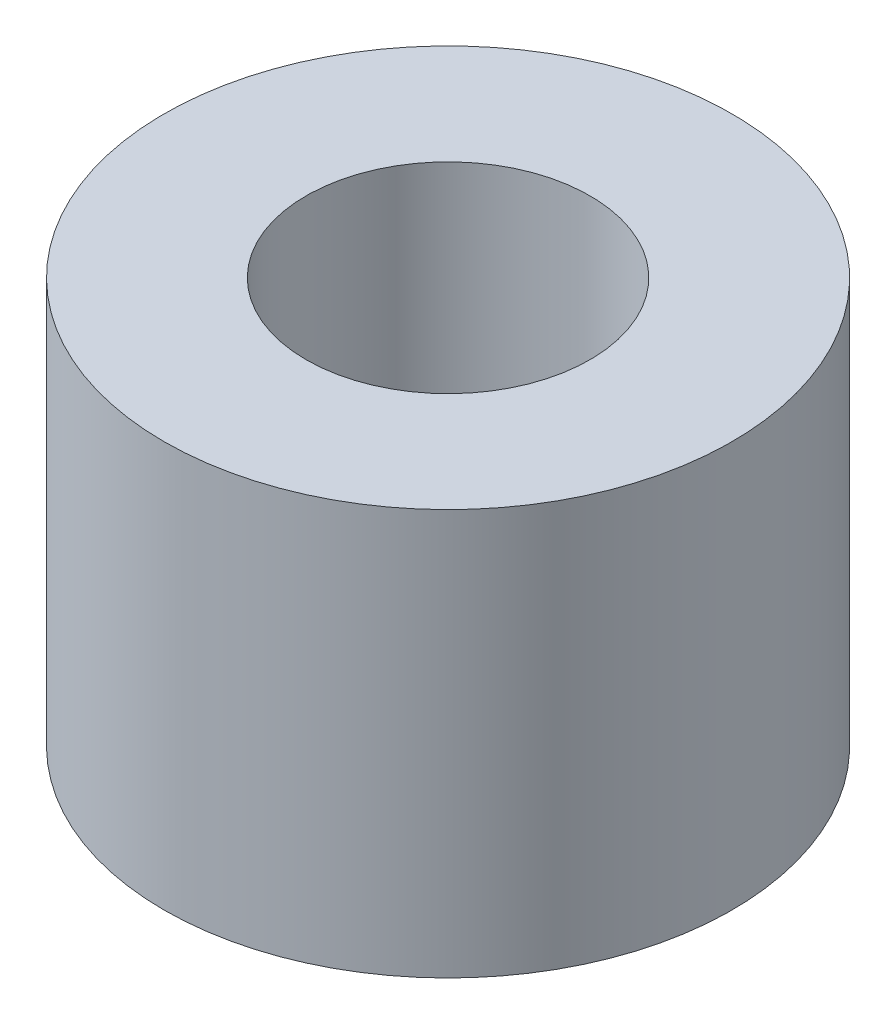
ISO-10303-21;
HEADER;
FILE_DESCRIPTION(('STEP AP214'),'2;1');
FILE_NAME('part.step','',(''),(''),'','','');
FILE_SCHEMA(('AUTOMOTIVE_DESIGN { 1 0 10303 214 1 1 1 1 }'));
ENDSEC;
DATA;
#1=APPLICATION_CONTEXT('core data for automotive mechanical design processes');
#2=APPLICATION_PROTOCOL_DEFINITION('international standard','automotive_design',2000,#1);
#3=PRODUCT_CONTEXT('',#1,'mechanical');
#4=PRODUCT('Part','Part','',(#3));
#5=PRODUCT_RELATED_PRODUCT_CATEGORY('part','',(#4));
#6=PRODUCT_DEFINITION_FORMATION('','',#4);
#7=PRODUCT_DEFINITION_CONTEXT('part definition',#1,'design');
#8=PRODUCT_DEFINITION('design','',#6,#7);
#9=PRODUCT_DEFINITION_SHAPE('','',#8);
#10=(LENGTH_UNIT() NAMED_UNIT(*) SI_UNIT(.MILLI.,.METRE.));
#11=(NAMED_UNIT(*) PLANE_ANGLE_UNIT() SI_UNIT($,.RADIAN.));
#12=(NAMED_UNIT(*) SI_UNIT($,.STERADIAN.) SOLID_ANGLE_UNIT());
#13=UNCERTAINTY_MEASURE_WITH_UNIT(LENGTH_MEASURE(1.E-05),#10,'distance_accuracy_value','');
#14=(GEOMETRIC_REPRESENTATION_CONTEXT(3) GLOBAL_UNCERTAINTY_ASSIGNED_CONTEXT((#13)) GLOBAL_UNIT_ASSIGNED_CONTEXT((#10,
#11,#12)) REPRESENTATION_CONTEXT('',''));
#15=CARTESIAN_POINT('',(0.,0.,0.));
#16=DIRECTION('',(0.,0.,1.));
#17=DIRECTION('',(1.,0.,0.));
#18=AXIS2_PLACEMENT_3D('',#15,#16,#17);
#19=CARTESIAN_POINT('',(0.,5.,0.));
#20=DIRECTION('',(0.,1.,0.));
#21=DIRECTION('',(0.,0.,1.));
#22=AXIS2_PLACEMENT_3D('',#19,#20,#21);
#23=PLANE('',#22);
#24=CARTESIAN_POINT('',(0.,5.,0.));
#25=DIRECTION('',(0.,1.,0.));
#26=DIRECTION('',(0.,0.,1.));
#27=AXIS2_PLACEMENT_3D('',#24,#25,#26);
#28=CIRCLE('',#27,3.5);
#29=CARTESIAN_POINT('',(0.,5.,3.5));
#30=VERTEX_POINT('',#29);
#31=EDGE_CURVE('E10',#30,#30,#28,.T.);
#32=ORIENTED_EDGE('',*,*,#31,.T.);
#33=EDGE_LOOP('',(#32));
#34=FACE_BOUND('',#33,.T.);
#35=CARTESIAN_POINT('',(0.,5.,0.));
#36=DIRECTION('',(0.,1.,0.));
#37=DIRECTION('',(0.,0.,1.));
#38=AXIS2_PLACEMENT_3D('',#35,#36,#37);
#39=CIRCLE('',#38,1.75);
#40=CARTESIAN_POINT('',(0.,5.,1.75));
#41=VERTEX_POINT('',#40);
#42=EDGE_CURVE('E44',#41,#41,#39,.T.);
#43=ORIENTED_EDGE('',*,*,#42,.F.);
#44=EDGE_LOOP('',(#43));
#45=FACE_BOUND('',#44,.T.);
#46=ADVANCED_FACE('F33',(#34,#45),#23,.T.);
#47=CARTESIAN_POINT('',(0.,0.,0.));
#48=DIRECTION('',(0.,1.,0.));
#49=DIRECTION('',(0.,0.,1.));
#50=AXIS2_PLACEMENT_3D('',#47,#48,#49);
#51=PLANE('',#50);
#52=CARTESIAN_POINT('',(0.,0.,0.));
#53=DIRECTION('',(0.,1.,0.));
#54=DIRECTION('',(0.,0.,1.));
#55=AXIS2_PLACEMENT_3D('',#52,#53,#54);
#56=CIRCLE('',#55,3.5);
#57=CARTESIAN_POINT('',(0.,0.,3.5));
#58=VERTEX_POINT('',#57);
#59=EDGE_CURVE('E37',#58,#58,#56,.T.);
#60=ORIENTED_EDGE('',*,*,#59,.F.);
#61=EDGE_LOOP('',(#60));
#62=FACE_BOUND('',#61,.T.);
#63=CARTESIAN_POINT('',(0.,0.,0.));
#64=DIRECTION('',(0.,1.,0.));
#65=DIRECTION('',(0.,0.,1.));
#66=AXIS2_PLACEMENT_3D('',#63,#64,#65);
#67=CIRCLE('',#66,1.75);
#68=CARTESIAN_POINT('',(0.,0.,1.75));
#69=VERTEX_POINT('',#68);
#70=EDGE_CURVE('E46',#69,#69,#67,.T.);
#71=ORIENTED_EDGE('',*,*,#70,.T.);
#72=EDGE_LOOP('',(#71));
#73=FACE_BOUND('',#72,.T.);
#74=ADVANCED_FACE('F56',(#62,#73),#51,.F.);
#75=CARTESIAN_POINT('',(0.,5.,0.));
#76=DIRECTION('',(0.,-1.,0.));
#77=DIRECTION('',(0.,0.,-1.));
#78=AXIS2_PLACEMENT_3D('',#75,#76,#77);
#79=CYLINDRICAL_SURFACE('',#78,3.5);
#80=ORIENTED_EDGE('',*,*,#31,.F.);
#81=EDGE_LOOP('',(#80));
#82=FACE_BOUND('',#81,.T.);
#83=ORIENTED_EDGE('',*,*,#59,.T.);
#84=EDGE_LOOP('',(#83));
#85=FACE_BOUND('',#84,.T.);
#86=ADVANCED_FACE('F35',(#82,#85),#79,.T.);
#87=CARTESIAN_POINT('',(0.,5.,0.));
#88=DIRECTION('',(0.,-1.,0.));
#89=DIRECTION('',(0.,0.,-1.));
#90=AXIS2_PLACEMENT_3D('',#87,#88,#89);
#91=CYLINDRICAL_SURFACE('',#90,1.75);
#92=ORIENTED_EDGE('',*,*,#42,.T.);
#93=EDGE_LOOP('',(#92));
#94=FACE_BOUND('',#93,.T.);
#95=ORIENTED_EDGE('',*,*,#70,.F.);
#96=EDGE_LOOP('',(#95));
#97=FACE_BOUND('',#96,.T.);
#98=ADVANCED_FACE('F52',(#94,#97),#91,.F.);
#99=CLOSED_SHELL('',(#46,#74,#86,#98));
#100=MANIFOLD_SOLID_BREP('B2',#99);
#101=ADVANCED_BREP_SHAPE_REPRESENTATION('',(#18,#100),#14);
#102=SHAPE_DEFINITION_REPRESENTATION(#9,#101);
ENDSEC;
END-ISO-10303-21;
